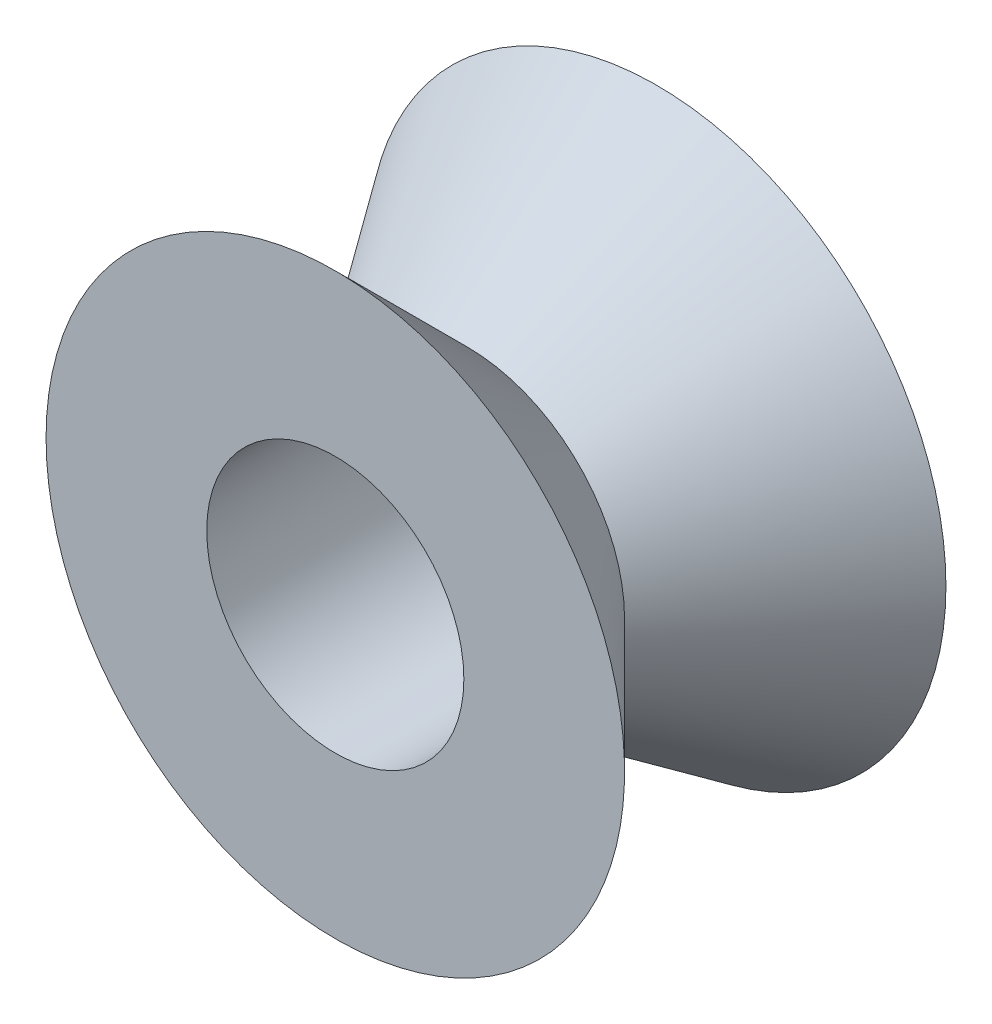
ISO-10303-21;
HEADER;
FILE_DESCRIPTION(('STEP AP214'),'2;1');
FILE_NAME('part.step','',(''),(''),'','','');
FILE_SCHEMA(('AUTOMOTIVE_DESIGN { 1 0 10303 214 1 1 1 1 }'));
ENDSEC;
DATA;
#1=APPLICATION_CONTEXT('core data for automotive mechanical design processes');
#2=APPLICATION_PROTOCOL_DEFINITION('international standard','automotive_design',2000,#1);
#3=PRODUCT_CONTEXT('',#1,'mechanical');
#4=PRODUCT('Part','Part','',(#3));
#5=PRODUCT_RELATED_PRODUCT_CATEGORY('part','',(#4));
#6=PRODUCT_DEFINITION_FORMATION('','',#4);
#7=PRODUCT_DEFINITION_CONTEXT('part definition',#1,'design');
#8=PRODUCT_DEFINITION('design','',#6,#7);
#9=PRODUCT_DEFINITION_SHAPE('','',#8);
#10=(LENGTH_UNIT() NAMED_UNIT(*) SI_UNIT(.MILLI.,.METRE.));
#11=(NAMED_UNIT(*) PLANE_ANGLE_UNIT() SI_UNIT($,.RADIAN.));
#12=(NAMED_UNIT(*) SI_UNIT($,.STERADIAN.) SOLID_ANGLE_UNIT());
#13=UNCERTAINTY_MEASURE_WITH_UNIT(LENGTH_MEASURE(1.E-05),#10,'distance_accuracy_value','');
#14=(GEOMETRIC_REPRESENTATION_CONTEXT(3) GLOBAL_UNCERTAINTY_ASSIGNED_CONTEXT((#13)) GLOBAL_UNIT_ASSIGNED_CONTEXT((#10,
#11,#12)) REPRESENTATION_CONTEXT('',''));
#15=CARTESIAN_POINT('',(0.,0.,0.));
#16=DIRECTION('',(0.,0.,1.));
#17=DIRECTION('',(1.,0.,0.));
#18=AXIS2_PLACEMENT_3D('',#15,#16,#17);
#19=CARTESIAN_POINT('',(0.,0.,0.));
#20=DIRECTION('',(0.,0.,-1.));
#21=DIRECTION('',(1.,0.,0.));
#22=AXIS2_PLACEMENT_3D('',#19,#20,#21);
#23=CONICAL_SURFACE('',#22,9.,0.610865238198017);
#24=CARTESIAN_POINT('',(0.,0.,0.));
#25=DIRECTION('',(0.,0.,1.));
#26=DIRECTION('',(1.,0.,0.));
#27=AXIS2_PLACEMENT_3D('',#24,#25,#26);
#28=CIRCLE('',#27,9.);
#29=CARTESIAN_POINT('',(9.,0.,0.));
#30=VERTEX_POINT('',#29);
#31=EDGE_CURVE('E44',#30,#30,#28,.T.);
#32=ORIENTED_EDGE('',*,*,#31,.T.);
#33=EDGE_LOOP('',(#32));
#34=FACE_BOUND('',#33,.T.);
#35=CARTESIAN_POINT('',(0.,0.,5.88163490354233));
#36=DIRECTION('',(0.,0.,1.));
#37=DIRECTION('',(1.,0.,0.));
#38=AXIS2_PLACEMENT_3D('',#35,#36,#37);
#39=CIRCLE('',#38,4.88163490354231);
#40=CARTESIAN_POINT('',(4.88163490354231,0.,5.88163490354233));
#41=VERTEX_POINT('',#40);
#42=EDGE_CURVE('E10',#41,#41,#39,.T.);
#43=ORIENTED_EDGE('',*,*,#42,.F.);
#44=EDGE_LOOP('',(#43));
#45=FACE_BOUND('',#44,.T.);
#46=ADVANCED_FACE('F37',(#34,#45),#23,.T.);
#47=CARTESIAN_POINT('',(0.,0.,0.));
#48=DIRECTION('',(0.,0.,1.));
#49=DIRECTION('',(1.,0.,0.));
#50=AXIS2_PLACEMENT_3D('',#47,#48,#49);
#51=PLANE('',#50);
#52=CARTESIAN_POINT('',(0.,0.,0.));
#53=DIRECTION('',(0.,0.,1.));
#54=DIRECTION('',(1.,0.,0.));
#55=AXIS2_PLACEMENT_3D('',#52,#53,#54);
#56=CIRCLE('',#55,4.);
#57=CARTESIAN_POINT('',(4.,0.,0.));
#58=VERTEX_POINT('',#57);
#59=EDGE_CURVE('E54',#58,#58,#56,.F.);
#60=ORIENTED_EDGE('',*,*,#59,.F.);
#61=EDGE_LOOP('',(#60));
#62=FACE_BOUND('',#61,.T.);
#63=ORIENTED_EDGE('',*,*,#31,.F.);
#64=EDGE_LOOP('',(#63));
#65=FACE_BOUND('',#64,.T.);
#66=ADVANCED_FACE('F74',(#62,#65),#51,.F.);
#67=CARTESIAN_POINT('',(0.,0.,10.));
#68=DIRECTION('',(0.,0.,1.));
#69=DIRECTION('',(-1.,0.,0.));
#70=AXIS2_PLACEMENT_3D('',#67,#68,#69);
#71=CONICAL_SURFACE('',#70,9.,0.78539816339745);
#72=CARTESIAN_POINT('',(0.,0.,10.));
#73=DIRECTION('',(0.,0.,-1.));
#74=DIRECTION('',(-1.,0.,0.));
#75=AXIS2_PLACEMENT_3D('',#72,#73,#74);
#76=CIRCLE('',#75,9.);
#77=CARTESIAN_POINT('',(-9.,0.,10.));
#78=VERTEX_POINT('',#77);
#79=EDGE_CURVE('E49',#78,#78,#76,.T.);
#80=ORIENTED_EDGE('',*,*,#79,.T.);
#81=EDGE_LOOP('',(#80));
#82=FACE_BOUND('',#81,.T.);
#83=ORIENTED_EDGE('',*,*,#42,.T.);
#84=EDGE_LOOP('',(#83));
#85=FACE_BOUND('',#84,.T.);
#86=ADVANCED_FACE('F77',(#82,#85),#71,.T.);
#87=CARTESIAN_POINT('',(0.,0.,10.));
#88=DIRECTION('',(0.,0.,1.));
#89=DIRECTION('',(1.,0.,0.));
#90=AXIS2_PLACEMENT_3D('',#87,#88,#89);
#91=PLANE('',#90);
#92=CARTESIAN_POINT('',(0.,0.,10.));
#93=DIRECTION('',(0.,0.,-1.));
#94=DIRECTION('',(-1.,0.,0.));
#95=AXIS2_PLACEMENT_3D('',#92,#93,#94);
#96=CIRCLE('',#95,4.);
#97=CARTESIAN_POINT('',(-4.,0.,10.));
#98=VERTEX_POINT('',#97);
#99=EDGE_CURVE('E60',#98,#98,#96,.T.);
#100=ORIENTED_EDGE('',*,*,#99,.T.);
#101=EDGE_LOOP('',(#100));
#102=FACE_BOUND('',#101,.T.);
#103=ORIENTED_EDGE('',*,*,#79,.F.);
#104=EDGE_LOOP('',(#103));
#105=FACE_BOUND('',#104,.T.);
#106=ADVANCED_FACE('F65',(#102,#105),#91,.T.);
#107=CARTESIAN_POINT('',(0.,0.,-10.));
#108=DIRECTION('',(0.,0.,1.));
#109=DIRECTION('',(1.,0.,0.));
#110=AXIS2_PLACEMENT_3D('',#107,#108,#109);
#111=CYLINDRICAL_SURFACE('',#110,4.);
#112=ORIENTED_EDGE('',*,*,#99,.F.);
#113=EDGE_LOOP('',(#112));
#114=FACE_BOUND('',#113,.T.);
#115=ORIENTED_EDGE('',*,*,#59,.T.);
#116=EDGE_LOOP('',(#115));
#117=FACE_BOUND('',#116,.T.);
#118=ADVANCED_FACE('F68',(#114,#117),#111,.F.);
#119=CLOSED_SHELL('',(#46,#66,#86,#106,#118));
#120=MANIFOLD_SOLID_BREP('B2',#119);
#121=ADVANCED_BREP_SHAPE_REPRESENTATION('',(#18,#120),#14);
#122=SHAPE_DEFINITION_REPRESENTATION(#9,#121);
ENDSEC;
END-ISO-10303-21;
